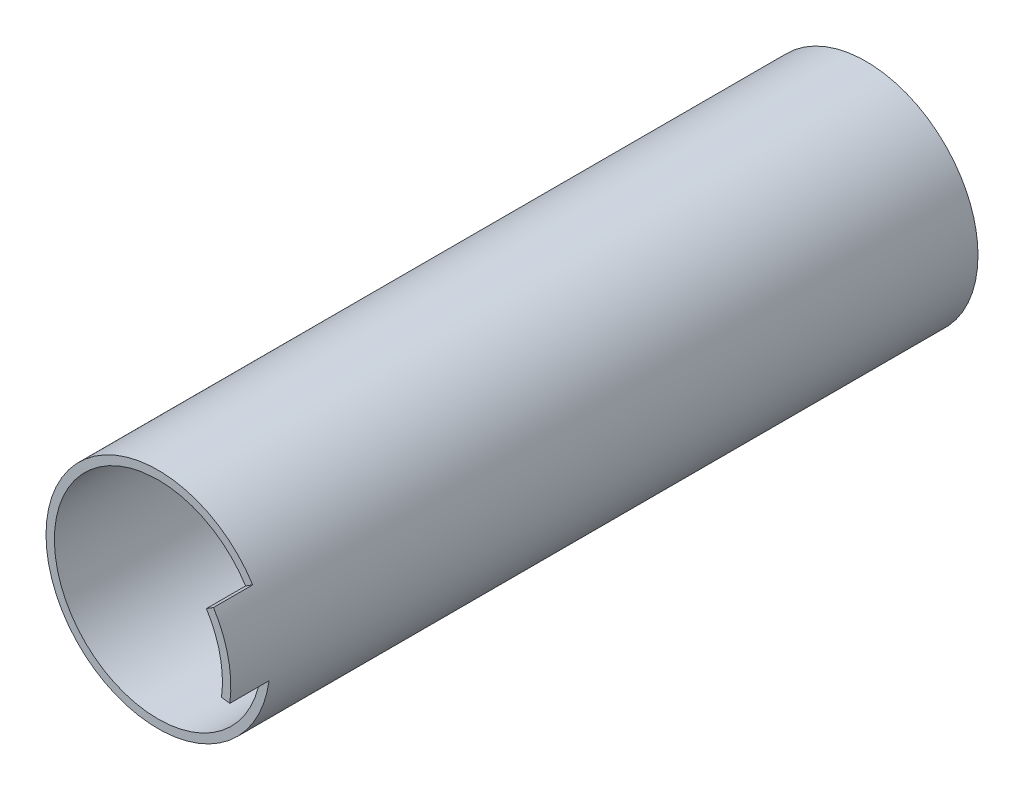
ISO-10303-21;
HEADER;
FILE_DESCRIPTION(('STEP AP214'),'2;1');
FILE_NAME('part.step','',(''),(''),'','','');
FILE_SCHEMA(('AUTOMOTIVE_DESIGN { 1 0 10303 214 1 1 1 1 }'));
ENDSEC;
DATA;
#1=APPLICATION_CONTEXT('core data for automotive mechanical design processes');
#2=APPLICATION_PROTOCOL_DEFINITION('international standard','automotive_design',2000,#1);
#3=PRODUCT_CONTEXT('',#1,'mechanical');
#4=PRODUCT('Part','Part','',(#3));
#5=PRODUCT_RELATED_PRODUCT_CATEGORY('part','',(#4));
#6=PRODUCT_DEFINITION_FORMATION('','',#4);
#7=PRODUCT_DEFINITION_CONTEXT('part definition',#1,'design');
#8=PRODUCT_DEFINITION('design','',#6,#7);
#9=PRODUCT_DEFINITION_SHAPE('','',#8);
#10=(LENGTH_UNIT() NAMED_UNIT(*) SI_UNIT(.MILLI.,.METRE.));
#11=(NAMED_UNIT(*) PLANE_ANGLE_UNIT() SI_UNIT($,.RADIAN.));
#12=(NAMED_UNIT(*) SI_UNIT($,.STERADIAN.) SOLID_ANGLE_UNIT());
#13=UNCERTAINTY_MEASURE_WITH_UNIT(LENGTH_MEASURE(1.E-05),#10,'distance_accuracy_value','');
#14=(GEOMETRIC_REPRESENTATION_CONTEXT(3) GLOBAL_UNCERTAINTY_ASSIGNED_CONTEXT((#13)) GLOBAL_UNIT_ASSIGNED_CONTEXT((#10,
#11,#12)) REPRESENTATION_CONTEXT('',''));
#15=CARTESIAN_POINT('',(0.,0.,0.));
#16=DIRECTION('',(0.,0.,1.));
#17=DIRECTION('',(1.,0.,0.));
#18=AXIS2_PLACEMENT_3D('',#15,#16,#17);
#19=CARTESIAN_POINT('',(0.,0.,0.));
#20=DIRECTION('',(0.,0.,-1.));
#21=DIRECTION('',(-1.,0.,0.));
#22=AXIS2_PLACEMENT_3D('',#19,#20,#21);
#23=PLANE('',#22);
#24=CARTESIAN_POINT('',(0.,0.,0.));
#25=DIRECTION('',(0.,0.,1.));
#26=DIRECTION('',(-1.,0.,0.));
#27=AXIS2_PLACEMENT_3D('',#24,#25,#26);
#28=CIRCLE('',#27,5.);
#29=CARTESIAN_POINT('',(-5.,0.,0.));
#30=VERTEX_POINT('',#29);
#31=CARTESIAN_POINT('',(5.,0.,0.));
#32=VERTEX_POINT('',#31);
#33=EDGE_CURVE('E104',#30,#32,#28,.T.);
#34=ORIENTED_EDGE('',*,*,#33,.F.);
#35=DIRECTION('',(0.,-1.,0.));
#36=VECTOR('',#35,1.);
#37=CARTESIAN_POINT('',(-5.,0.,0.));
#38=LINE('',#37,#36);
#39=CARTESIAN_POINT('',(-5.,16.7705098312484,0.));
#40=VERTEX_POINT('',#39);
#41=EDGE_CURVE('E58',#40,#30,#38,.T.);
#42=ORIENTED_EDGE('',*,*,#41,.F.);
#43=CARTESIAN_POINT('',(0.,0.,0.));
#44=DIRECTION('',(0.,0.,1.));
#45=DIRECTION('',(1.,0.,0.));
#46=AXIS2_PLACEMENT_3D('',#43,#44,#45);
#47=CIRCLE('',#46,17.5);
#48=CARTESIAN_POINT('',(5.,16.7705098312484,0.));
#49=VERTEX_POINT('',#48);
#50=EDGE_CURVE('E105',#49,#40,#47,.T.);
#51=ORIENTED_EDGE('',*,*,#50,.F.);
#52=DIRECTION('',(0.,1.,0.));
#53=VECTOR('',#52,1.);
#54=CARTESIAN_POINT('',(5.,0.,0.));
#55=LINE('',#54,#53);
#56=EDGE_CURVE('E94',#32,#49,#55,.T.);
#57=ORIENTED_EDGE('',*,*,#56,.F.);
#58=EDGE_LOOP('',(#34,#42,#51,#57));
#59=FACE_BOUND('',#58,.T.);
#60=CARTESIAN_POINT('',(0.,0.,0.));
#61=DIRECTION('',(0.,0.,1.));
#62=DIRECTION('',(1.,0.,0.));
#63=AXIS2_PLACEMENT_3D('',#60,#61,#62);
#64=CIRCLE('',#63,2.99999999999862);
#65=CARTESIAN_POINT('',(2.99999999999862,0.,0.));
#66=VERTEX_POINT('',#65);
#67=EDGE_CURVE('E117',#66,#66,#64,.T.);
#68=ORIENTED_EDGE('',*,*,#67,.T.);
#69=EDGE_LOOP('',(#68));
#70=FACE_BOUND('',#69,.T.);
#71=ADVANCED_FACE('F49',(#59,#70),#23,.T.);
#72=CARTESIAN_POINT('',(0.,0.,83.6221445044903));
#73=DIRECTION('',(0.,0.,-1.));
#74=DIRECTION('',(-1.,0.,0.));
#75=AXIS2_PLACEMENT_3D('',#72,#73,#74);
#76=CYLINDRICAL_SURFACE('',#75,5.);
#77=DIRECTION('',(0.,0.,-1.));
#78=VECTOR('',#77,1.);
#79=CARTESIAN_POINT('',(5.,0.,83.6221445044903));
#80=LINE('',#79,#78);
#81=CARTESIAN_POINT('',(5.,0.,58.6));
#82=VERTEX_POINT('',#81);
#83=EDGE_CURVE('E91',#82,#32,#80,.T.);
#84=ORIENTED_EDGE('',*,*,#83,.F.);
#85=CARTESIAN_POINT('',(0.,0.,58.6));
#86=DIRECTION('',(0.,0.,-1.));
#87=DIRECTION('',(-1.,0.,0.));
#88=AXIS2_PLACEMENT_3D('',#85,#86,#87);
#89=CIRCLE('',#88,5.);
#90=CARTESIAN_POINT('',(-5.,0.,58.6));
#91=VERTEX_POINT('',#90);
#92=EDGE_CURVE('E66',#82,#91,#89,.T.);
#93=ORIENTED_EDGE('',*,*,#92,.T.);
#94=DIRECTION('',(0.,0.,-1.));
#95=VECTOR('',#94,1.);
#96=CARTESIAN_POINT('',(-5.,0.,83.6221445044903));
#97=LINE('',#96,#95);
#98=EDGE_CURVE('E110',#91,#30,#97,.T.);
#99=ORIENTED_EDGE('',*,*,#98,.T.);
#100=ORIENTED_EDGE('',*,*,#33,.T.);
#101=EDGE_LOOP('',(#84,#93,#99,#100));
#102=FACE_BOUND('',#101,.T.);
#103=ADVANCED_FACE('F108',(#102),#76,.T.);
#104=CARTESIAN_POINT('',(5.,0.,83.6221445044903));
#105=DIRECTION('',(-1.,0.,0.));
#106=DIRECTION('',(0.,-1.,0.));
#107=AXIS2_PLACEMENT_3D('',#104,#105,#106);
#108=PLANE('',#107);
#109=DIRECTION('',(0.,0.,-1.));
#110=VECTOR('',#109,1.);
#111=CARTESIAN_POINT('',(5.,16.7705098312484,83.6221445044903));
#112=LINE('',#111,#110);
#113=CARTESIAN_POINT('',(5.,16.7705098312484,58.6));
#114=VERTEX_POINT('',#113);
#115=EDGE_CURVE('E86',#114,#49,#112,.T.);
#116=ORIENTED_EDGE('',*,*,#115,.F.);
#117=DIRECTION('',(0.,-1.,0.));
#118=VECTOR('',#117,1.);
#119=CARTESIAN_POINT('',(5.,0.,58.6));
#120=LINE('',#119,#118);
#121=EDGE_CURVE('E96',#114,#82,#120,.T.);
#122=ORIENTED_EDGE('',*,*,#121,.T.);
#123=ORIENTED_EDGE('',*,*,#83,.T.);
#124=ORIENTED_EDGE('',*,*,#56,.T.);
#125=EDGE_LOOP('',(#116,#122,#123,#124));
#126=FACE_BOUND('',#125,.T.);
#127=ADVANCED_FACE('F93',(#126),#108,.F.);
#128=CARTESIAN_POINT('',(0.,0.,83.6221445044903));
#129=DIRECTION('',(0.,0.,-1.));
#130=DIRECTION('',(-1.,0.,0.));
#131=AXIS2_PLACEMENT_3D('',#128,#129,#130);
#132=CYLINDRICAL_SURFACE('',#131,17.5);
#133=DIRECTION('',(0.,0.,-1.));
#134=VECTOR('',#133,1.);
#135=CARTESIAN_POINT('',(-5.,16.7705098312484,83.6221445044903));
#136=LINE('',#135,#134);
#137=CARTESIAN_POINT('',(-5.,16.7705098312484,58.6));
#138=VERTEX_POINT('',#137);
#139=EDGE_CURVE('E121',#138,#40,#136,.T.);
#140=ORIENTED_EDGE('',*,*,#139,.F.);
#141=CARTESIAN_POINT('',(0.,0.,58.6));
#142=DIRECTION('',(0.,0.,-1.));
#143=DIRECTION('',(-1.,0.,0.));
#144=AXIS2_PLACEMENT_3D('',#141,#142,#143);
#145=CIRCLE('',#144,17.5);
#146=EDGE_CURVE('E106',#138,#114,#145,.T.);
#147=ORIENTED_EDGE('',*,*,#146,.T.);
#148=ORIENTED_EDGE('',*,*,#115,.T.);
#149=ORIENTED_EDGE('',*,*,#50,.T.);
#150=EDGE_LOOP('',(#140,#147,#148,#149));
#151=FACE_BOUND('',#150,.T.);
#152=ADVANCED_FACE('F130',(#151),#132,.T.);
#153=CARTESIAN_POINT('',(-5.,0.,83.6221445044903));
#154=DIRECTION('',(1.,0.,0.));
#155=DIRECTION('',(0.,1.,0.));
#156=AXIS2_PLACEMENT_3D('',#153,#154,#155);
#157=PLANE('',#156);
#158=ORIENTED_EDGE('',*,*,#98,.F.);
#159=DIRECTION('',(0.,1.,0.));
#160=VECTOR('',#159,1.);
#161=CARTESIAN_POINT('',(-5.,0.,58.6));
#162=LINE('',#161,#160);
#163=EDGE_CURVE('E122',#91,#138,#162,.T.);
#164=ORIENTED_EDGE('',*,*,#163,.T.);
#165=ORIENTED_EDGE('',*,*,#139,.T.);
#166=ORIENTED_EDGE('',*,*,#41,.T.);
#167=EDGE_LOOP('',(#158,#164,#165,#166));
#168=FACE_BOUND('',#167,.T.);
#169=ADVANCED_FACE('F129',(#168),#157,.F.);
#170=CARTESIAN_POINT('',(0.,0.,83.6221445044903));
#171=DIRECTION('',(0.,0.,-1.));
#172=DIRECTION('',(-1.,0.,0.));
#173=AXIS2_PLACEMENT_3D('',#170,#171,#172);
#174=CYLINDRICAL_SURFACE('',#173,2.99999999999862);
#175=CARTESIAN_POINT('',(0.,0.,58.6));
#176=DIRECTION('',(0.,0.,-1.));
#177=DIRECTION('',(-1.,0.,0.));
#178=AXIS2_PLACEMENT_3D('',#175,#176,#177);
#179=CIRCLE('',#178,2.99999999999862);
#180=CARTESIAN_POINT('',(-2.99999999999862,0.,58.6));
#181=VERTEX_POINT('',#180);
#182=EDGE_CURVE('E13',#181,#181,#179,.T.);
#183=ORIENTED_EDGE('',*,*,#182,.F.);
#184=EDGE_LOOP('',(#183));
#185=FACE_BOUND('',#184,.T.);
#186=ORIENTED_EDGE('',*,*,#67,.F.);
#187=EDGE_LOOP('',(#186));
#188=FACE_BOUND('',#187,.T.);
#189=ADVANCED_FACE('F132',(#185,#188),#174,.F.);
#190=CARTESIAN_POINT('',(0.,-5.01335084557297E-13,58.6));
#191=DIRECTION('',(0.,0.,-1.));
#192=DIRECTION('',(-1.,0.,0.));
#193=AXIS2_PLACEMENT_3D('',#190,#191,#192);
#194=PLANE('',#193);
#195=ORIENTED_EDGE('',*,*,#182,.T.);
#196=EDGE_LOOP('',(#195));
#197=FACE_BOUND('',#196,.T.);
#198=ORIENTED_EDGE('',*,*,#121,.F.);
#199=ORIENTED_EDGE('',*,*,#146,.F.);
#200=ORIENTED_EDGE('',*,*,#163,.F.);
#201=ORIENTED_EDGE('',*,*,#92,.F.);
#202=EDGE_LOOP('',(#198,#199,#200,#201));
#203=FACE_BOUND('',#202,.T.);
#204=ADVANCED_FACE('F51',(#197,#203),#194,.F.);
#205=CLOSED_SHELL('',(#71,#103,#127,#152,#169,#189,#204));
#206=MANIFOLD_SOLID_BREP('B2',#205);
#207=CARTESIAN_POINT('',(-7.41124908692476,8.1285538056629,126.4));
#208=DIRECTION('',(0.,0.,-1.));
#209=DIRECTION('',(-1.,0.,0.));
#210=AXIS2_PLACEMENT_3D('',#207,#208,#209);
#211=CYLINDRICAL_SURFACE('',#210,6.);
#212=CARTESIAN_POINT('',(-7.41124908692476,8.1285538056629,67.4));
#213=DIRECTION('',(0.,0.,-1.));
#214=DIRECTION('',(-1.,0.,0.));
#215=AXIS2_PLACEMENT_3D('',#212,#213,#214);
#216=CIRCLE('',#215,6.);
#217=CARTESIAN_POINT('',(-1.49013878743609,9.09832327377844,67.4));
#218=VERTEX_POINT('',#217);
#219=CARTESIAN_POINT('',(-3.3687495849658,3.69479718439223,67.4));
#220=VERTEX_POINT('',#219);
#221=EDGE_CURVE('E319',#218,#220,#216,.T.);
#222=ORIENTED_EDGE('',*,*,#221,.F.);
#223=DIRECTION('',(0.,0.,-1.));
#224=VECTOR('',#223,1.);
#225=CARTESIAN_POINT('',(-1.49013878743609,9.09832327377844,126.4));
#226=LINE('',#225,#224);
#227=CARTESIAN_POINT('',(-1.49013878743609,9.09832327377844,59.));
#228=VERTEX_POINT('',#227);
#229=EDGE_CURVE('E352',#218,#228,#226,.T.);
#230=ORIENTED_EDGE('',*,*,#229,.T.);
#231=CARTESIAN_POINT('',(-7.41124908692476,8.1285538056629,59.));
#232=DIRECTION('',(0.,0.,-1.));
#233=DIRECTION('',(-1.,0.,0.));
#234=AXIS2_PLACEMENT_3D('',#231,#232,#233);
#235=CIRCLE('',#234,6.);
#236=CARTESIAN_POINT('',(-3.3687495849658,3.69479718439223,59.));
#237=VERTEX_POINT('',#236);
#238=EDGE_CURVE('E340',#228,#237,#235,.T.);
#239=ORIENTED_EDGE('',*,*,#238,.T.);
#240=DIRECTION('',(0.,0.,-1.));
#241=VECTOR('',#240,1.);
#242=CARTESIAN_POINT('',(-3.3687495849658,3.69479718439223,126.4));
#243=LINE('',#242,#241);
#244=EDGE_CURVE('E353',#220,#237,#243,.T.);
#245=ORIENTED_EDGE('',*,*,#244,.F.);
#246=EDGE_LOOP('',(#222,#230,#239,#245));
#247=FACE_BOUND('',#246,.T.);
#248=ADVANCED_FACE('F195',(#247),#211,.F.);
#249=CARTESIAN_POINT('',(0.,0.,126.4));
#250=DIRECTION('',(0.,0.,-1.));
#251=DIRECTION('',(-1.,0.,0.));
#252=AXIS2_PLACEMENT_3D('',#249,#250,#251);
#253=CYLINDRICAL_SURFACE('',#252,5.);
#254=CARTESIAN_POINT('',(0.,0.,67.4));
#255=DIRECTION('',(0.,0.,-1.));
#256=DIRECTION('',(-1.,0.,0.));
#257=AXIS2_PLACEMENT_3D('',#254,#255,#256);
#258=CIRCLE('',#257,5.);
#259=CARTESIAN_POINT('',(2.72727272727273,4.19070202604222,67.4));
#260=VERTEX_POINT('',#259);
#261=EDGE_CURVE('E321',#220,#260,#258,.F.);
#262=ORIENTED_EDGE('',*,*,#261,.F.);
#263=ORIENTED_EDGE('',*,*,#244,.T.);
#264=CARTESIAN_POINT('',(0.,0.,59.));
#265=DIRECTION('',(0.,0.,-1.));
#266=DIRECTION('',(-1.,0.,0.));
#267=AXIS2_PLACEMENT_3D('',#264,#265,#266);
#268=CIRCLE('',#267,5.);
#269=CARTESIAN_POINT('',(2.72727272727273,4.19070202604222,59.));
#270=VERTEX_POINT('',#269);
#271=EDGE_CURVE('E343',#237,#270,#268,.F.);
#272=ORIENTED_EDGE('',*,*,#271,.T.);
#273=DIRECTION('',(0.,0.,-1.));
#274=VECTOR('',#273,1.);
#275=CARTESIAN_POINT('',(2.72727272727273,4.19070202604222,126.4));
#276=LINE('',#275,#274);
#277=EDGE_CURVE('E356',#260,#270,#276,.T.);
#278=ORIENTED_EDGE('',*,*,#277,.F.);
#279=EDGE_LOOP('',(#262,#263,#272,#278));
#280=FACE_BOUND('',#279,.T.);
#281=ADVANCED_FACE('F409',(#280),#253,.T.);
#282=CARTESIAN_POINT('',(6.,9.21954445729289,126.4));
#283=DIRECTION('',(0.,0.,-1.));
#284=DIRECTION('',(-1.,0.,0.));
#285=AXIS2_PLACEMENT_3D('',#282,#283,#284);
#286=CYLINDRICAL_SURFACE('',#285,6.);
#287=CARTESIAN_POINT('',(6.,9.21954445729289,67.4));
#288=DIRECTION('',(0.,0.,-1.));
#289=DIRECTION('',(-1.,0.,0.));
#290=AXIS2_PLACEMENT_3D('',#287,#288,#289);
#291=CIRCLE('',#290,6.);
#292=CARTESIAN_POINT('',(0.,9.21954445729289,67.4));
#293=VERTEX_POINT('',#292);
#294=EDGE_CURVE('E323',#260,#293,#291,.T.);
#295=ORIENTED_EDGE('',*,*,#294,.F.);
#296=ORIENTED_EDGE('',*,*,#277,.T.);
#297=CARTESIAN_POINT('',(6.,9.21954445729289,59.));
#298=DIRECTION('',(0.,0.,-1.));
#299=DIRECTION('',(-1.,0.,0.));
#300=AXIS2_PLACEMENT_3D('',#297,#298,#299);
#301=CIRCLE('',#300,6.);
#302=CARTESIAN_POINT('',(0.,9.21954445729289,59.));
#303=VERTEX_POINT('',#302);
#304=EDGE_CURVE('E346',#270,#303,#301,.T.);
#305=ORIENTED_EDGE('',*,*,#304,.T.);
#306=DIRECTION('',(0.,0.,-1.));
#307=VECTOR('',#306,1.);
#308=CARTESIAN_POINT('',(0.,9.21954445729289,126.4));
#309=LINE('',#308,#307);
#310=EDGE_CURVE('E358',#293,#303,#309,.T.);
#311=ORIENTED_EDGE('',*,*,#310,.F.);
#312=EDGE_LOOP('',(#295,#296,#305,#311));
#313=FACE_BOUND('',#312,.T.);
#314=ADVANCED_FACE('F404',(#313),#286,.F.);
#315=CARTESIAN_POINT('',(0.,18.5,126.4));
#316=DIRECTION('',(1.,0.,0.));
#317=DIRECTION('',(0.,1.,0.));
#318=AXIS2_PLACEMENT_3D('',#315,#316,#317);
#319=PLANE('',#318);
#320=DIRECTION('',(0.,1.,0.));
#321=VECTOR('',#320,1.);
#322=CARTESIAN_POINT('',(0.,18.5,67.4));
#323=LINE('',#322,#321);
#324=CARTESIAN_POINT('',(0.,18.5,67.4));
#325=VERTEX_POINT('',#324);
#326=EDGE_CURVE('E325',#293,#325,#323,.T.);
#327=ORIENTED_EDGE('',*,*,#326,.F.);
#328=ORIENTED_EDGE('',*,*,#310,.T.);
#329=DIRECTION('',(0.,1.,0.));
#330=VECTOR('',#329,1.);
#331=CARTESIAN_POINT('',(0.,18.5,59.));
#332=LINE('',#331,#330);
#333=CARTESIAN_POINT('',(0.,18.5,59.));
#334=VERTEX_POINT('',#333);
#335=EDGE_CURVE('E349',#303,#334,#332,.T.);
#336=ORIENTED_EDGE('',*,*,#335,.T.);
#337=DIRECTION('',(0.,0.,-1.));
#338=VECTOR('',#337,1.);
#339=CARTESIAN_POINT('',(0.,18.5,126.4));
#340=LINE('',#339,#338);
#341=EDGE_CURVE('E363',#325,#334,#340,.T.);
#342=ORIENTED_EDGE('',*,*,#341,.F.);
#343=EDGE_LOOP('',(#327,#328,#336,#342));
#344=FACE_BOUND('',#343,.T.);
#345=ADVANCED_FACE('F400',(#344),#319,.T.);
#346=CARTESIAN_POINT('',(-2.99012252668958,18.2567567567568,126.4));
#347=DIRECTION('',(-0.986851716581446,-0.161628244685923,0.));
#348=DIRECTION('',(0.161628244685923,-0.986851716581447,0.));
#349=AXIS2_PLACEMENT_3D('',#346,#347,#348);
#350=PLANE('',#349);
#351=DIRECTION('',(0.161628244685923,-0.986851716581447,0.));
#352=VECTOR('',#351,1.);
#353=CARTESIAN_POINT('',(-2.99012252668958,18.2567567567568,67.4));
#354=LINE('',#353,#352);
#355=CARTESIAN_POINT('',(-2.99012252668958,18.2567567567568,67.4));
#356=VERTEX_POINT('',#355);
#357=EDGE_CURVE('E317',#356,#218,#354,.T.);
#358=ORIENTED_EDGE('',*,*,#357,.F.);
#359=DIRECTION('',(0.,0.,-1.));
#360=VECTOR('',#359,1.);
#361=CARTESIAN_POINT('',(-2.99012252668958,18.2567567567568,126.4));
#362=LINE('',#361,#360);
#363=CARTESIAN_POINT('',(-2.99012252668958,18.2567567567568,59.));
#364=VERTEX_POINT('',#363);
#365=EDGE_CURVE('E366',#356,#364,#362,.T.);
#366=ORIENTED_EDGE('',*,*,#365,.T.);
#367=DIRECTION('',(0.161628244685923,-0.986851716581447,0.));
#368=VECTOR('',#367,1.);
#369=CARTESIAN_POINT('',(-2.99012252668958,18.2567567567568,59.));
#370=LINE('',#369,#368);
#371=EDGE_CURVE('E337',#364,#228,#370,.T.);
#372=ORIENTED_EDGE('',*,*,#371,.T.);
#373=ORIENTED_EDGE('',*,*,#229,.F.);
#374=EDGE_LOOP('',(#358,#366,#372,#373));
#375=FACE_BOUND('',#374,.T.);
#376=ADVANCED_FACE('F416',(#375),#350,.T.);
#377=CARTESIAN_POINT('',(0.,0.,126.4));
#378=DIRECTION('',(0.,0.,-1.));
#379=DIRECTION('',(-1.,0.,0.));
#380=AXIS2_PLACEMENT_3D('',#377,#378,#379);
#381=CYLINDRICAL_SURFACE('',#380,3.);
#382=CARTESIAN_POINT('',(0.,0.,67.4));
#383=DIRECTION('',(0.,0.,-1.));
#384=DIRECTION('',(-1.,0.,0.));
#385=AXIS2_PLACEMENT_3D('',#382,#383,#384);
#386=CIRCLE('',#385,3.);
#387=CARTESIAN_POINT('',(-3.,0.,67.4));
#388=VERTEX_POINT('',#387);
#389=EDGE_CURVE('E313',#388,#388,#386,.F.);
#390=ORIENTED_EDGE('',*,*,#389,.T.);
#391=EDGE_LOOP('',(#390));
#392=FACE_BOUND('',#391,.T.);
#393=CARTESIAN_POINT('',(0.,0.,59.));
#394=DIRECTION('',(0.,0.,-1.));
#395=DIRECTION('',(-1.,0.,0.));
#396=AXIS2_PLACEMENT_3D('',#393,#394,#395);
#397=CIRCLE('',#396,3.);
#398=CARTESIAN_POINT('',(-3.,0.,59.));
#399=VERTEX_POINT('',#398);
#400=EDGE_CURVE('E199',#399,#399,#397,.F.);
#401=ORIENTED_EDGE('',*,*,#400,.F.);
#402=EDGE_LOOP('',(#401));
#403=FACE_BOUND('',#402,.T.);
#404=ADVANCED_FACE('F441',(#392,#403),#381,.F.);
#405=CARTESIAN_POINT('',(0.,0.,126.4));
#406=DIRECTION('',(0.,0.,1.));
#407=DIRECTION('',(1.,0.,0.));
#408=AXIS2_PLACEMENT_3D('',#405,#406,#407);
#409=PLANE('',#408);
#410=DIRECTION('',(0.991029909341494,-0.133640258869065,0.));
#411=VECTOR('',#410,1.);
#412=CARTESIAN_POINT('',(19.8205981868299,-2.6728051773813,126.4));
#413=LINE('',#412,#411);
#414=CARTESIAN_POINT('',(18.3340533228176,-2.4723447890777,126.4));
#415=VERTEX_POINT('',#414);
#416=CARTESIAN_POINT('',(19.8205981868299,-2.6728051773813,126.4));
#417=VERTEX_POINT('',#416);
#418=EDGE_CURVE('E301',#415,#417,#413,.T.);
#419=ORIENTED_EDGE('',*,*,#418,.F.);
#420=CARTESIAN_POINT('',(0.,0.,126.4));
#421=DIRECTION('',(0.,0.,1.));
#422=DIRECTION('',(1.,0.,0.));
#423=AXIS2_PLACEMENT_3D('',#420,#421,#422);
#424=CIRCLE('',#423,18.5);
#425=CARTESIAN_POINT('',(-2.99012252668958,18.2567567567568,126.4));
#426=VERTEX_POINT('',#425);
#427=EDGE_CURVE('E368',#426,#415,#424,.T.);
#428=ORIENTED_EDGE('',*,*,#427,.F.);
#429=DIRECTION('',(-0.996707508896528,-0.0810810810810807,0.));
#430=VECTOR('',#429,1.);
#431=CARTESIAN_POINT('',(0.,18.5,126.4));
#432=LINE('',#431,#430);
#433=CARTESIAN_POINT('',(0.,18.5,126.4));
#434=VERTEX_POINT('',#433);
#435=EDGE_CURVE('E304',#434,#426,#432,.T.);
#436=ORIENTED_EDGE('',*,*,#435,.F.);
#437=CARTESIAN_POINT('',(15.6338922650837,9.89097632409239,126.4));
#438=VERTEX_POINT('',#437);
#439=EDGE_CURVE('E371',#438,#434,#424,.T.);
#440=ORIENTED_EDGE('',*,*,#439,.F.);
#441=DIRECTION('',(-0.845075257572092,-0.534647368869859,0.));
#442=VECTOR('',#441,1.);
#443=CARTESIAN_POINT('',(16.9015051514418,10.6929473773972,126.4));
#444=LINE('',#443,#442);
#445=CARTESIAN_POINT('',(16.9015051514418,10.6929473773972,126.4));
#446=VERTEX_POINT('',#445);
#447=EDGE_CURVE('E215',#446,#438,#444,.T.);
#448=ORIENTED_EDGE('',*,*,#447,.F.);
#449=CARTESIAN_POINT('',(0.,0.,126.4));
#450=DIRECTION('',(0.,0.,1.));
#451=DIRECTION('',(1.,0.,0.));
#452=AXIS2_PLACEMENT_3D('',#449,#450,#451);
#453=CIRCLE('',#452,20.);
#454=EDGE_CURVE('E47',#446,#417,#453,.T.);
#455=ORIENTED_EDGE('',*,*,#454,.T.);
#456=EDGE_LOOP('',(#419,#428,#436,#440,#448,#455));
#457=FACE_BOUND('',#456,.T.);
#458=ADVANCED_FACE('F379',(#457),#409,.T.);
#459=CARTESIAN_POINT('',(0.,0.,0.));
#460=DIRECTION('',(0.,0.,1.));
#461=DIRECTION('',(1.,0.,0.));
#462=AXIS2_PLACEMENT_3D('',#459,#460,#461);
#463=PLANE('',#462);
#464=CARTESIAN_POINT('',(0.,0.,0.));
#465=DIRECTION('',(0.,0.,1.));
#466=DIRECTION('',(1.,0.,0.));
#467=AXIS2_PLACEMENT_3D('',#464,#465,#466);
#468=CIRCLE('',#467,20.);
#469=CARTESIAN_POINT('',(20.,0.,0.));
#470=VERTEX_POINT('',#469);
#471=EDGE_CURVE('E204',#470,#470,#468,.T.);
#472=ORIENTED_EDGE('',*,*,#471,.F.);
#473=EDGE_LOOP('',(#472));
#474=FACE_BOUND('',#473,.T.);
#475=CARTESIAN_POINT('',(0.,0.,0.));
#476=DIRECTION('',(0.,0.,1.));
#477=DIRECTION('',(1.,0.,0.));
#478=AXIS2_PLACEMENT_3D('',#475,#476,#477);
#479=CIRCLE('',#478,18.5);
#480=CARTESIAN_POINT('',(-2.99012252668958,18.2567567567568,0.));
#481=VERTEX_POINT('',#480);
#482=CARTESIAN_POINT('',(0.,18.5,0.));
#483=VERTEX_POINT('',#482);
#484=EDGE_CURVE('E355',#481,#483,#479,.T.);
#485=ORIENTED_EDGE('',*,*,#484,.T.);
#486=DIRECTION('',(0.996707508896528,0.0810810810810807,0.));
#487=VECTOR('',#486,1.);
#488=CARTESIAN_POINT('',(0.,18.5,0.));
#489=LINE('',#488,#487);
#490=EDGE_CURVE('E327',#481,#483,#489,.T.);
#491=ORIENTED_EDGE('',*,*,#490,.F.);
#492=EDGE_LOOP('',(#485,#491));
#493=FACE_BOUND('',#492,.T.);
#494=ADVANCED_FACE('F376',(#474,#493),#463,.F.);
#495=CARTESIAN_POINT('',(0.,0.,126.4));
#496=DIRECTION('',(0.,0.,-1.));
#497=DIRECTION('',(-1.,0.,0.));
#498=AXIS2_PLACEMENT_3D('',#495,#496,#497);
#499=CYLINDRICAL_SURFACE('',#498,20.);
#500=ORIENTED_EDGE('',*,*,#454,.F.);
#501=DIRECTION('',(0.,0.,-1.));
#502=VECTOR('',#501,1.);
#503=CARTESIAN_POINT('',(16.9015051514418,10.6929473773972,133.4));
#504=LINE('',#503,#502);
#505=CARTESIAN_POINT('',(16.9015051514418,10.6929473773972,133.4));
#506=VERTEX_POINT('',#505);
#507=EDGE_CURVE('E286',#506,#446,#504,.T.);
#508=ORIENTED_EDGE('',*,*,#507,.F.);
#509=CARTESIAN_POINT('',(0.,0.,133.4));
#510=DIRECTION('',(0.,0.,1.));
#511=DIRECTION('',(-1.,0.,0.));
#512=AXIS2_PLACEMENT_3D('',#509,#510,#511);
#513=CIRCLE('',#512,20.);
#514=CARTESIAN_POINT('',(19.8205981868299,-2.6728051773813,133.4));
#515=VERTEX_POINT('',#514);
#516=EDGE_CURVE('E292',#515,#506,#513,.T.);
#517=ORIENTED_EDGE('',*,*,#516,.F.);
#518=DIRECTION('',(0.,0.,-1.));
#519=VECTOR('',#518,1.);
#520=CARTESIAN_POINT('',(19.8205981868299,-2.6728051773813,133.4));
#521=LINE('',#520,#519);
#522=EDGE_CURVE('E429',#515,#417,#521,.T.);
#523=ORIENTED_EDGE('',*,*,#522,.T.);
#524=EDGE_LOOP('',(#500,#508,#517,#523));
#525=FACE_BOUND('',#524,.T.);
#526=ORIENTED_EDGE('',*,*,#471,.T.);
#527=EDGE_LOOP('',(#526));
#528=FACE_BOUND('',#527,.T.);
#529=ADVANCED_FACE('F197',(#525,#528),#499,.T.);
#530=CARTESIAN_POINT('',(0.,0.,126.4));
#531=DIRECTION('',(0.,0.,-1.));
#532=DIRECTION('',(-1.,0.,0.));
#533=AXIS2_PLACEMENT_3D('',#530,#531,#532);
#534=CYLINDRICAL_SURFACE('',#533,18.5);
#535=ORIENTED_EDGE('',*,*,#365,.F.);
#536=EDGE_CURVE('E364',#426,#356,#362,.T.);
#537=ORIENTED_EDGE('',*,*,#536,.F.);
#538=ORIENTED_EDGE('',*,*,#427,.T.);
#539=DIRECTION('',(0.,0.,-1.));
#540=VECTOR('',#539,1.);
#541=CARTESIAN_POINT('',(18.3340533228176,-2.4723447890777,133.4));
#542=LINE('',#541,#540);
#543=CARTESIAN_POINT('',(18.3340533228176,-2.4723447890777,133.4));
#544=VERTEX_POINT('',#543);
#545=EDGE_CURVE('E308',#544,#415,#542,.T.);
#546=ORIENTED_EDGE('',*,*,#545,.F.);
#547=CARTESIAN_POINT('',(0.,0.,133.4));
#548=DIRECTION('',(0.,0.,-1.));
#549=DIRECTION('',(-1.,0.,0.));
#550=AXIS2_PLACEMENT_3D('',#547,#548,#549);
#551=CIRCLE('',#550,18.5);
#552=CARTESIAN_POINT('',(15.6338922650837,9.89097632409239,133.4));
#553=VERTEX_POINT('',#552);
#554=EDGE_CURVE('E291',#553,#544,#551,.T.);
#555=ORIENTED_EDGE('',*,*,#554,.F.);
#556=DIRECTION('',(0.,0.,-1.));
#557=VECTOR('',#556,1.);
#558=CARTESIAN_POINT('',(15.6338922650837,9.89097632409239,133.4));
#559=LINE('',#558,#557);
#560=EDGE_CURVE('E288',#553,#438,#559,.T.);
#561=ORIENTED_EDGE('',*,*,#560,.T.);
#562=ORIENTED_EDGE('',*,*,#439,.T.);
#563=EDGE_CURVE('E360',#434,#325,#340,.T.);
#564=ORIENTED_EDGE('',*,*,#563,.T.);
#565=ORIENTED_EDGE('',*,*,#341,.T.);
#566=DIRECTION('',(0.,0.,-1.));
#567=VECTOR('',#566,1.);
#568=CARTESIAN_POINT('',(0.,18.5,59.));
#569=LINE('',#568,#567);
#570=EDGE_CURVE('E333',#334,#483,#569,.T.);
#571=ORIENTED_EDGE('',*,*,#570,.T.);
#572=ORIENTED_EDGE('',*,*,#484,.F.);
#573=DIRECTION('',(0.,0.,-1.));
#574=VECTOR('',#573,1.);
#575=CARTESIAN_POINT('',(-2.99012252668958,18.2567567567568,59.));
#576=LINE('',#575,#574);
#577=EDGE_CURVE('E331',#364,#481,#576,.T.);
#578=ORIENTED_EDGE('',*,*,#577,.F.);
#579=EDGE_LOOP('',(#535,#537,#538,#546,#555,#561,#562,#564,#565,#571,#572,#578));
#580=FACE_BOUND('',#579,.T.);
#581=ADVANCED_FACE('F385',(#580),#534,.F.);
#582=CARTESIAN_POINT('',(0.,-5.01335084557297E-13,59.));
#583=DIRECTION('',(0.,0.,-1.));
#584=DIRECTION('',(-1.,0.,0.));
#585=AXIS2_PLACEMENT_3D('',#582,#583,#584);
#586=PLANE('',#585);
#587=ORIENTED_EDGE('',*,*,#304,.F.);
#588=ORIENTED_EDGE('',*,*,#271,.F.);
#589=ORIENTED_EDGE('',*,*,#238,.F.);
#590=ORIENTED_EDGE('',*,*,#371,.F.);
#591=DIRECTION('',(0.996707508896528,0.0810810810810807,0.));
#592=VECTOR('',#591,1.);
#593=CARTESIAN_POINT('',(0.,18.5,59.));
#594=LINE('',#593,#592);
#595=EDGE_CURVE('E328',#364,#334,#594,.T.);
#596=ORIENTED_EDGE('',*,*,#595,.T.);
#597=ORIENTED_EDGE('',*,*,#335,.F.);
#598=EDGE_LOOP('',(#587,#588,#589,#590,#596,#597));
#599=FACE_BOUND('',#598,.T.);
#600=ORIENTED_EDGE('',*,*,#400,.T.);
#601=EDGE_LOOP('',(#600));
#602=FACE_BOUND('',#601,.T.);
#603=ADVANCED_FACE('F395',(#599,#602),#586,.T.);
#604=CARTESIAN_POINT('',(0.,18.5,59.));
#605=DIRECTION('',(-0.0810810810810807,0.996707508896528,0.));
#606=DIRECTION('',(-0.996707508896528,-0.0810810810810807,0.));
#607=AXIS2_PLACEMENT_3D('',#604,#605,#606);
#608=PLANE('',#607);
#609=ORIENTED_EDGE('',*,*,#490,.T.);
#610=ORIENTED_EDGE('',*,*,#570,.F.);
#611=ORIENTED_EDGE('',*,*,#595,.F.);
#612=ORIENTED_EDGE('',*,*,#577,.T.);
#613=EDGE_LOOP('',(#609,#610,#611,#612));
#614=FACE_BOUND('',#613,.T.);
#615=ADVANCED_FACE('F390',(#614),#608,.F.);
#616=CARTESIAN_POINT('',(2.05508176448488E-07,-2.52625562309483E-06,67.4));
#617=DIRECTION('',(0.,0.,-1.));
#618=DIRECTION('',(-1.,0.,0.));
#619=AXIS2_PLACEMENT_3D('',#616,#617,#618);
#620=PLANE('',#619);
#621=ORIENTED_EDGE('',*,*,#326,.T.);
#622=DIRECTION('',(-0.996707508896528,-0.0810810810810807,0.));
#623=VECTOR('',#622,1.);
#624=CARTESIAN_POINT('',(0.,18.5,67.4));
#625=LINE('',#624,#623);
#626=EDGE_CURVE('E306',#325,#356,#625,.T.);
#627=ORIENTED_EDGE('',*,*,#626,.T.);
#628=ORIENTED_EDGE('',*,*,#357,.T.);
#629=ORIENTED_EDGE('',*,*,#221,.T.);
#630=ORIENTED_EDGE('',*,*,#261,.T.);
#631=ORIENTED_EDGE('',*,*,#294,.T.);
#632=EDGE_LOOP('',(#621,#627,#628,#629,#630,#631));
#633=FACE_BOUND('',#632,.T.);
#634=ORIENTED_EDGE('',*,*,#389,.F.);
#635=EDGE_LOOP('',(#634));
#636=FACE_BOUND('',#635,.T.);
#637=ADVANCED_FACE('F435',(#633,#636),#620,.F.);
#638=CARTESIAN_POINT('',(0.,18.5,67.4));
#639=DIRECTION('',(-0.0810810810810807,0.996707508896528,0.));
#640=DIRECTION('',(-0.996707508896528,-0.0810810810810807,0.));
#641=AXIS2_PLACEMENT_3D('',#638,#639,#640);
#642=PLANE('',#641);
#643=ORIENTED_EDGE('',*,*,#435,.T.);
#644=ORIENTED_EDGE('',*,*,#536,.T.);
#645=ORIENTED_EDGE('',*,*,#626,.F.);
#646=ORIENTED_EDGE('',*,*,#563,.F.);
#647=EDGE_LOOP('',(#643,#644,#645,#646));
#648=FACE_BOUND('',#647,.T.);
#649=ADVANCED_FACE('F433',(#648),#642,.F.);
#650=CARTESIAN_POINT('',(16.9015051514418,10.6929473773972,133.4));
#651=DIRECTION('',(0.534647368869858,-0.845075257572092,0.));
#652=DIRECTION('',(0.845075257572092,0.534647368869858,0.));
#653=AXIS2_PLACEMENT_3D('',#650,#651,#652);
#654=PLANE('',#653);
#655=ORIENTED_EDGE('',*,*,#447,.T.);
#656=ORIENTED_EDGE('',*,*,#560,.F.);
#657=DIRECTION('',(-0.845075257572092,-0.534647368869859,0.));
#658=VECTOR('',#657,1.);
#659=CARTESIAN_POINT('',(16.9015051514418,10.6929473773972,133.4));
#660=LINE('',#659,#658);
#661=EDGE_CURVE('E282',#506,#553,#660,.T.);
#662=ORIENTED_EDGE('',*,*,#661,.F.);
#663=ORIENTED_EDGE('',*,*,#507,.T.);
#664=EDGE_LOOP('',(#655,#656,#662,#663));
#665=FACE_BOUND('',#664,.T.);
#666=ADVANCED_FACE('F284',(#665),#654,.F.);
#667=CARTESIAN_POINT('',(19.8205981868299,-2.6728051773813,133.4));
#668=DIRECTION('',(0.133640258869065,0.991029909341494,0.));
#669=DIRECTION('',(-0.991029909341494,0.133640258869065,0.));
#670=AXIS2_PLACEMENT_3D('',#667,#668,#669);
#671=PLANE('',#670);
#672=ORIENTED_EDGE('',*,*,#418,.T.);
#673=ORIENTED_EDGE('',*,*,#522,.F.);
#674=DIRECTION('',(0.991029909341494,-0.133640258869065,0.));
#675=VECTOR('',#674,1.);
#676=CARTESIAN_POINT('',(19.8205981868299,-2.6728051773813,133.4));
#677=LINE('',#676,#675);
#678=EDGE_CURVE('E297',#544,#515,#677,.T.);
#679=ORIENTED_EDGE('',*,*,#678,.F.);
#680=ORIENTED_EDGE('',*,*,#545,.T.);
#681=EDGE_LOOP('',(#672,#673,#679,#680));
#682=FACE_BOUND('',#681,.T.);
#683=ADVANCED_FACE('F430',(#682),#671,.F.);
#684=CARTESIAN_POINT('',(0.,0.,133.4));
#685=DIRECTION('',(0.,0.,-1.));
#686=DIRECTION('',(-1.,0.,0.));
#687=AXIS2_PLACEMENT_3D('',#684,#685,#686);
#688=PLANE('',#687);
#689=ORIENTED_EDGE('',*,*,#516,.T.);
#690=ORIENTED_EDGE('',*,*,#661,.T.);
#691=ORIENTED_EDGE('',*,*,#554,.T.);
#692=ORIENTED_EDGE('',*,*,#678,.T.);
#693=EDGE_LOOP('',(#689,#690,#691,#692));
#694=FACE_BOUND('',#693,.T.);
#695=ADVANCED_FACE('F295',(#694),#688,.F.);
#696=CLOSED_SHELL('',(#248,#281,#314,#345,#376,#404,#458,#494,#529,#581,#603,#615,#637,#649,
#666,#683,#695));
#697=MANIFOLD_SOLID_BREP('B7',#696);
#698=ADVANCED_BREP_SHAPE_REPRESENTATION('',(#18,#206,#697),#14);
#699=SHAPE_DEFINITION_REPRESENTATION(#9,#698);
ENDSEC;
END-ISO-10303-21;
